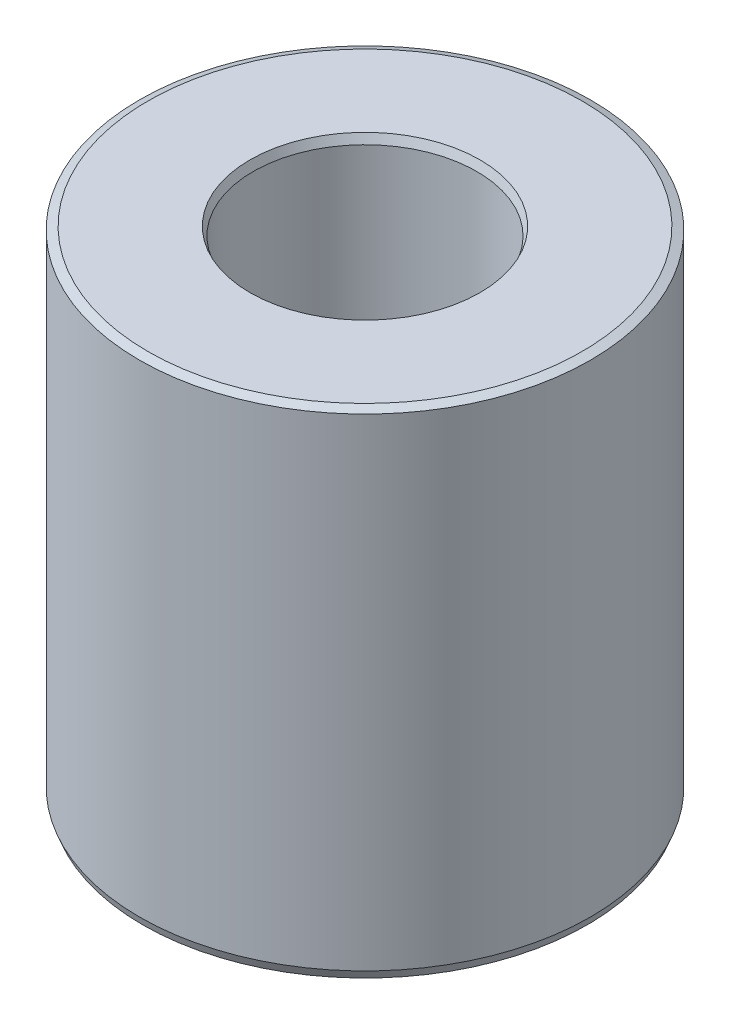
ISO-10303-21;
HEADER;
FILE_DESCRIPTION(('STEP AP214'),'2;1');
FILE_NAME('part.step','',(''),(''),'','','');
FILE_SCHEMA(('AUTOMOTIVE_DESIGN { 1 0 10303 214 1 1 1 1 }'));
ENDSEC;
DATA;
#1=APPLICATION_CONTEXT('core data for automotive mechanical design processes');
#2=APPLICATION_PROTOCOL_DEFINITION('international standard','automotive_design',2000,#1);
#3=PRODUCT_CONTEXT('',#1,'mechanical');
#4=PRODUCT('Part','Part','',(#3));
#5=PRODUCT_RELATED_PRODUCT_CATEGORY('part','',(#4));
#6=PRODUCT_DEFINITION_FORMATION('','',#4);
#7=PRODUCT_DEFINITION_CONTEXT('part definition',#1,'design');
#8=PRODUCT_DEFINITION('design','',#6,#7);
#9=PRODUCT_DEFINITION_SHAPE('','',#8);
#10=(LENGTH_UNIT() NAMED_UNIT(*) SI_UNIT(.MILLI.,.METRE.));
#11=(NAMED_UNIT(*) PLANE_ANGLE_UNIT() SI_UNIT($,.RADIAN.));
#12=(NAMED_UNIT(*) SI_UNIT($,.STERADIAN.) SOLID_ANGLE_UNIT());
#13=UNCERTAINTY_MEASURE_WITH_UNIT(LENGTH_MEASURE(1.E-05),#10,'distance_accuracy_value','');
#14=(GEOMETRIC_REPRESENTATION_CONTEXT(3) GLOBAL_UNCERTAINTY_ASSIGNED_CONTEXT((#13)) GLOBAL_UNIT_ASSIGNED_CONTEXT((#10,
#11,#12)) REPRESENTATION_CONTEXT('',''));
#15=CARTESIAN_POINT('',(0.,0.,0.));
#16=DIRECTION('',(0.,0.,1.));
#17=DIRECTION('',(1.,0.,0.));
#18=AXIS2_PLACEMENT_3D('',#15,#16,#17);
#19=CARTESIAN_POINT('',(0.,104.050931708156,0.));
#20=DIRECTION('',(0.,-1.,0.));
#21=DIRECTION('',(0.,0.,-1.));
#22=AXIS2_PLACEMENT_3D('',#19,#20,#21);
#23=CYLINDRICAL_SURFACE('',#22,47.5);
#24=CARTESIAN_POINT('',(0.,1.77992751208642,0.));
#25=DIRECTION('',(0.,1.,0.));
#26=DIRECTION('',(0.,0.,1.));
#27=AXIS2_PLACEMENT_3D('',#24,#25,#26);
#28=CIRCLE('',#27,47.5);
#29=CARTESIAN_POINT('',(0.,1.77992751208642,47.5));
#30=VERTEX_POINT('',#29);
#31=EDGE_CURVE('E10',#30,#30,#28,.T.);
#32=ORIENTED_EDGE('',*,*,#31,.T.);
#33=EDGE_LOOP('',(#32));
#34=FACE_BOUND('',#33,.T.);
#35=CARTESIAN_POINT('',(0.,103.366580565094,0.));
#36=DIRECTION('',(0.,1.,0.));
#37=DIRECTION('',(0.,0.,1.));
#38=AXIS2_PLACEMENT_3D('',#35,#36,#37);
#39=CIRCLE('',#38,47.5);
#40=CARTESIAN_POINT('',(0.,103.366580565094,47.5));
#41=VERTEX_POINT('',#40);
#42=EDGE_CURVE('E50',#41,#41,#39,.F.);
#43=ORIENTED_EDGE('',*,*,#42,.T.);
#44=EDGE_LOOP('',(#43));
#45=FACE_BOUND('',#44,.T.);
#46=ADVANCED_FACE('F39',(#34,#45),#23,.T.);
#47=CARTESIAN_POINT('',(0.,104.050931708156,0.));
#48=DIRECTION('',(0.,1.,0.));
#49=DIRECTION('',(0.,0.,1.));
#50=AXIS2_PLACEMENT_3D('',#47,#48,#49);
#51=PLANE('',#50);
#52=CARTESIAN_POINT('',(0.,104.050931708156,0.));
#53=DIRECTION('',(0.,1.,0.));
#54=DIRECTION('',(0.,0.,1.));
#55=AXIS2_PLACEMENT_3D('',#52,#53,#54);
#56=CIRCLE('',#55,24.2334809256156);
#57=CARTESIAN_POINT('',(0.,104.050931708156,24.2334809256156));
#58=VERTEX_POINT('',#57);
#59=EDGE_CURVE('E58',#58,#58,#56,.F.);
#60=ORIENTED_EDGE('',*,*,#59,.T.);
#61=EDGE_LOOP('',(#60));
#62=FACE_BOUND('',#61,.T.);
#63=CARTESIAN_POINT('',(0.,104.050931708156,0.));
#64=DIRECTION('',(0.,1.,0.));
#65=DIRECTION('',(0.,0.,1.));
#66=AXIS2_PLACEMENT_3D('',#63,#64,#65);
#67=CIRCLE('',#66,45.7200724879134);
#68=CARTESIAN_POINT('',(0.,104.050931708156,45.7200724879134));
#69=VERTEX_POINT('',#68);
#70=EDGE_CURVE('E61',#69,#69,#67,.T.);
#71=ORIENTED_EDGE('',*,*,#70,.T.);
#72=EDGE_LOOP('',(#71));
#73=FACE_BOUND('',#72,.T.);
#74=ADVANCED_FACE('F88',(#62,#73),#51,.T.);
#75=CARTESIAN_POINT('',(0.,0.,0.));
#76=DIRECTION('',(0.,1.,0.));
#77=DIRECTION('',(0.,0.,1.));
#78=AXIS2_PLACEMENT_3D('',#75,#76,#77);
#79=PLANE('',#78);
#80=CARTESIAN_POINT('',(0.,0.,0.));
#81=DIRECTION('',(0.,1.,0.));
#82=DIRECTION('',(0.,0.,1.));
#83=AXIS2_PLACEMENT_3D('',#80,#81,#82);
#84=CIRCLE('',#83,25.3290572946398);
#85=CARTESIAN_POINT('',(0.,0.,25.3290572946398));
#86=VERTEX_POINT('',#85);
#87=EDGE_CURVE('E51',#86,#86,#84,.T.);
#88=ORIENTED_EDGE('',*,*,#87,.T.);
#89=EDGE_LOOP('',(#88));
#90=FACE_BOUND('',#89,.T.);
#91=CARTESIAN_POINT('',(0.,0.,0.));
#92=DIRECTION('',(0.,1.,0.));
#93=DIRECTION('',(0.,0.,1.));
#94=AXIS2_PLACEMENT_3D('',#91,#92,#93);
#95=CIRCLE('',#94,46.8156488569377);
#96=CARTESIAN_POINT('',(0.,0.,46.8156488569377));
#97=VERTEX_POINT('',#96);
#98=EDGE_CURVE('E54',#97,#97,#95,.F.);
#99=ORIENTED_EDGE('',*,*,#98,.T.);
#100=EDGE_LOOP('',(#99));
#101=FACE_BOUND('',#100,.T.);
#102=ADVANCED_FACE('F83',(#90,#101),#79,.F.);
#103=CARTESIAN_POINT('',(0.,104.050931708156,0.));
#104=DIRECTION('',(0.,-1.,0.));
#105=DIRECTION('',(0.,0.,-1.));
#106=AXIS2_PLACEMENT_3D('',#103,#104,#105);
#107=CYLINDRICAL_SURFACE('',#106,23.5491297825532);
#108=CARTESIAN_POINT('',(0.,102.27100419607,0.));
#109=DIRECTION('',(0.,1.,0.));
#110=DIRECTION('',(0.,0.,1.));
#111=AXIS2_PLACEMENT_3D('',#108,#109,#110);
#112=CIRCLE('',#111,23.5491297825532);
#113=CARTESIAN_POINT('',(0.,102.27100419607,23.5491297825532));
#114=VERTEX_POINT('',#113);
#115=EDGE_CURVE('E67',#114,#114,#112,.T.);
#116=ORIENTED_EDGE('',*,*,#115,.T.);
#117=EDGE_LOOP('',(#116));
#118=FACE_BOUND('',#117,.T.);
#119=CARTESIAN_POINT('',(0.,0.684351143062381,0.));
#120=DIRECTION('',(0.,1.,0.));
#121=DIRECTION('',(0.,0.,1.));
#122=AXIS2_PLACEMENT_3D('',#119,#120,#121);
#123=CIRCLE('',#122,23.5491297825532);
#124=CARTESIAN_POINT('',(0.,0.684351143062381,23.5491297825532));
#125=VERTEX_POINT('',#124);
#126=EDGE_CURVE('E69',#125,#125,#123,.F.);
#127=ORIENTED_EDGE('',*,*,#126,.T.);
#128=EDGE_LOOP('',(#127));
#129=FACE_BOUND('',#128,.T.);
#130=ADVANCED_FACE('F71',(#118,#129),#107,.F.);
#131=CARTESIAN_POINT('',(0.,102.27100419607,0.));
#132=DIRECTION('',(0.,1.,0.));
#133=DIRECTION('',(0.,0.,1.));
#134=AXIS2_PLACEMENT_3D('',#131,#132,#133);
#135=CONICAL_SURFACE('',#134,23.5491297825532,0.367058148332036);
#136=ORIENTED_EDGE('',*,*,#59,.F.);
#137=EDGE_LOOP('',(#136));
#138=FACE_BOUND('',#137,.T.);
#139=ORIENTED_EDGE('',*,*,#115,.F.);
#140=EDGE_LOOP('',(#139));
#141=FACE_BOUND('',#140,.T.);
#142=ADVANCED_FACE('F77',(#138,#141),#135,.F.);
#143=CARTESIAN_POINT('',(0.,0.,0.));
#144=DIRECTION('',(0.,-1.,0.));
#145=DIRECTION('',(0.,0.,-1.));
#146=AXIS2_PLACEMENT_3D('',#143,#144,#145);
#147=CONICAL_SURFACE('',#146,25.3290572946398,1.20373817846286);
#148=ORIENTED_EDGE('',*,*,#126,.F.);
#149=EDGE_LOOP('',(#148));
#150=FACE_BOUND('',#149,.T.);
#151=ORIENTED_EDGE('',*,*,#87,.F.);
#152=EDGE_LOOP('',(#151));
#153=FACE_BOUND('',#152,.T.);
#154=ADVANCED_FACE('F73',(#150,#153),#147,.F.);
#155=CARTESIAN_POINT('',(0.,1.77992751208642,0.));
#156=DIRECTION('',(0.,1.,0.));
#157=DIRECTION('',(0.,0.,1.));
#158=AXIS2_PLACEMENT_3D('',#155,#156,#157);
#159=CONICAL_SURFACE('',#158,47.5,0.367058148332039);
#160=CARTESIAN_POINT('',(0.,0.,46.8156488569377));
#161=CARTESIAN_POINT('',(0.,0.0185409115842333,46.8227775146779));
#162=CARTESIAN_POINT('',(0.,0.0370818231684668,46.8299061724182));
#163=CARTESIAN_POINT('',(0.,0.0741636463369337,46.8441634878986));
#164=CARTESIAN_POINT('',(0.,0.0927045579211673,46.8512921456389));
#165=CARTESIAN_POINT('',(0.,0.129786381089634,46.8655494611193));
#166=CARTESIAN_POINT('',(0.,0.148327292673868,46.8726781188596));
#167=CARTESIAN_POINT('',(0.,0.185409115842335,46.88693543434));
#168=CARTESIAN_POINT('',(0.,0.203950027426568,46.8940640920802));
#169=CARTESIAN_POINT('',(0.,0.241031850595035,46.9083214075607));
#170=CARTESIAN_POINT('',(0.,0.259572762179269,46.915450065301));
#171=CARTESIAN_POINT('',(0.,0.296654585347736,46.9297073807814));
#172=CARTESIAN_POINT('',(0.,0.315195496931969,46.9368360385216));
#173=CARTESIAN_POINT('',(0.,0.352277320100436,46.9510933540021));
#174=CARTESIAN_POINT('',(0.,0.37081823168467,46.9582220117423));
#175=CARTESIAN_POINT('',(0.,0.407900054853137,46.9724793272228));
#176=CARTESIAN_POINT('',(0.,0.42644096643737,46.979607984963));
#177=CARTESIAN_POINT('',(0.,0.463522789605837,46.9938653004435));
#178=CARTESIAN_POINT('',(0.,0.482063701190071,47.0009939581837));
#179=CARTESIAN_POINT('',(0.,0.519145524358538,47.0152512736642));
#180=CARTESIAN_POINT('',(0.,0.537686435942771,47.0223799314044));
#181=CARTESIAN_POINT('',(0.,0.574768259111238,47.0366372468849));
#182=CARTESIAN_POINT('',(0.,0.593309170695472,47.0437659046251));
#183=CARTESIAN_POINT('',(0.,0.630390993863939,47.0580232201056));
#184=CARTESIAN_POINT('',(0.,0.648931905448172,47.0651518778458));
#185=CARTESIAN_POINT('',(0.,0.686013728616639,47.0794091933263));
#186=CARTESIAN_POINT('',(0.,0.704554640200873,47.0865378510665));
#187=CARTESIAN_POINT('',(0.,0.74163646336934,47.100795166547));
#188=CARTESIAN_POINT('',(0.,0.760177374953573,47.1079238242872));
#189=CARTESIAN_POINT('',(0.,0.79725919812204,47.1221811397677));
#190=CARTESIAN_POINT('',(0.,0.815800109706274,47.1293097975079));
#191=CARTESIAN_POINT('',(0.,0.852881932874741,47.1435671129884));
#192=CARTESIAN_POINT('',(0.,0.871422844458974,47.1506957707286));
#193=CARTESIAN_POINT('',(0.,0.908504667627441,47.1649530862091));
#194=CARTESIAN_POINT('',(0.,0.927045579211675,47.1720817439493));
#195=CARTESIAN_POINT('',(0.,0.964127402380142,47.1863390594298));
#196=CARTESIAN_POINT('',(0.,0.982668313964375,47.19346771717));
#197=CARTESIAN_POINT('',(0.,1.01975013713284,47.2077250326505));
#198=CARTESIAN_POINT('',(0.,1.03829104871708,47.2148536903907));
#199=CARTESIAN_POINT('',(0.,1.07537287188554,47.2291110058712));
#200=CARTESIAN_POINT('',(0.,1.09391378346978,47.2362396636114));
#201=CARTESIAN_POINT('',(0.,1.13099560663824,47.2504969790919));
#202=CARTESIAN_POINT('',(0.,1.14953651822248,47.2576256368321));
#203=CARTESIAN_POINT('',(0.,1.18661834139094,47.2718829523126));
#204=CARTESIAN_POINT('',(0.,1.20515925297518,47.2790116100528));
#205=CARTESIAN_POINT('',(0.,1.24224107614364,47.2932689255333));
#206=CARTESIAN_POINT('',(0.,1.26078198772788,47.3003975832735));
#207=CARTESIAN_POINT('',(0.,1.29786381089634,47.314654898754));
#208=CARTESIAN_POINT('',(0.,1.31640472248058,47.3217835564942));
#209=CARTESIAN_POINT('',(0.,1.35348654564905,47.3360408719747));
#210=CARTESIAN_POINT('',(0.,1.37202745723328,47.3431695297149));
#211=CARTESIAN_POINT('',(0.,1.40910928040175,47.3574268451954));
#212=CARTESIAN_POINT('',(0.,1.42765019198598,47.3645555029356));
#213=CARTESIAN_POINT('',(0.,1.46473201515445,47.3788128184161));
#214=CARTESIAN_POINT('',(0.,1.48327292673868,47.3859414761563));
#215=CARTESIAN_POINT('',(0.,1.52035474990715,47.4001987916368));
#216=CARTESIAN_POINT('',(0.,1.53889566149138,47.407327449377));
#217=CARTESIAN_POINT('',(0.,1.57597748465985,47.4215847648574));
#218=CARTESIAN_POINT('',(0.,1.59451839624408,47.4287134225977));
#219=CARTESIAN_POINT('',(0.,1.63160021941255,47.4429707380781));
#220=CARTESIAN_POINT('',(0.,1.65014113099678,47.4500993958184));
#221=CARTESIAN_POINT('',(0.,1.68722295416525,47.4643567112988));
#222=CARTESIAN_POINT('',(0.,1.70576386574948,47.4714853690391));
#223=CARTESIAN_POINT('',(0.,1.74284568891795,47.4857426845195));
#224=CARTESIAN_POINT('',(0.,1.76138660050218,47.4928713422598));
#225=CARTESIAN_POINT('',(0.,1.77992751208642,47.5));
#226=B_SPLINE_CURVE_WITH_KNOTS('',3,(#160,#161,#162,#163,#164,#165,#166,#167,#168,#169,#170,
#171,#172,#173,#174,#175,#176,#177,#178,#179,#180,#181,#182,#183,#184,#185,#186,#187,#188,#189,
#190,#191,#192,#193,#194,#195,#196,#197,#198,#199,#200,#201,#202,#203,#204,#205,#206,#207,#208,
#209,#210,#211,#212,#213,#214,#215,#216,#217,#218,#219,#220,#221,#222,#223,#224,#225),
.UNSPECIFIED.,.F.,.F.,(4,2,2,2,2,2,2,2,2,2,2,2,2,2,2,2,2,2,2,2,2,2,2,2,2,2,2,2,2,2,2,2,4),(0.,
0.0595923524620874,0.119184704924175,0.178777057386262,0.23836940984835,0.297961762310437,
0.357554114772524,0.417146467234612,0.476738819696699,0.536331172158787,0.595923524620874,
0.655515877082962,0.715108229545049,0.774700582007137,0.834292934469224,0.893885286931311,
0.953477639393399,1.01306999185549,1.07266234431757,1.13225469677966,1.19184704924175,
1.25143940170384,1.31103175416592,1.37062410662801,1.4302164590901,1.48980881155218,
1.54940116401427,1.60899351647636,1.66858586893845,1.72817822140053,1.78777057386262,
1.84736292632471,1.9069552787868),.UNSPECIFIED.);
#227=EDGE_CURVE('BSEAM76',#97,#30,#226,.T.);
#228=ORIENTED_EDGE('',*,*,#98,.F.);
#229=ORIENTED_EDGE('',*,*,#31,.F.);
#230=ORIENTED_EDGE('',*,*,#227,.T.);
#231=ORIENTED_EDGE('',*,*,#227,.F.);
#232=EDGE_LOOP('',(#228,#230,#229,#231));
#233=FACE_BOUND('',#232,.T.);
#234=ADVANCED_FACE('F76',(#233),#159,.T.);
#235=CARTESIAN_POINT('',(0.,104.050931708156,0.));
#236=DIRECTION('',(0.,-1.,0.));
#237=DIRECTION('',(0.,0.,-1.));
#238=AXIS2_PLACEMENT_3D('',#235,#236,#237);
#239=CONICAL_SURFACE('',#238,45.7200724879134,1.20373817846286);
#240=ORIENTED_EDGE('',*,*,#42,.F.);
#241=EDGE_LOOP('',(#240));
#242=FACE_BOUND('',#241,.T.);
#243=ORIENTED_EDGE('',*,*,#70,.F.);
#244=EDGE_LOOP('',(#243));
#245=FACE_BOUND('',#244,.T.);
#246=ADVANCED_FACE('F45',(#242,#245),#239,.T.);
#247=CLOSED_SHELL('',(#46,#74,#102,#130,#142,#154,#234,#246));
#248=MANIFOLD_SOLID_BREP('B2',#247);
#249=ADVANCED_BREP_SHAPE_REPRESENTATION('',(#18,#248),#14);
#250=SHAPE_DEFINITION_REPRESENTATION(#9,#249);
ENDSEC;
END-ISO-10303-21;
